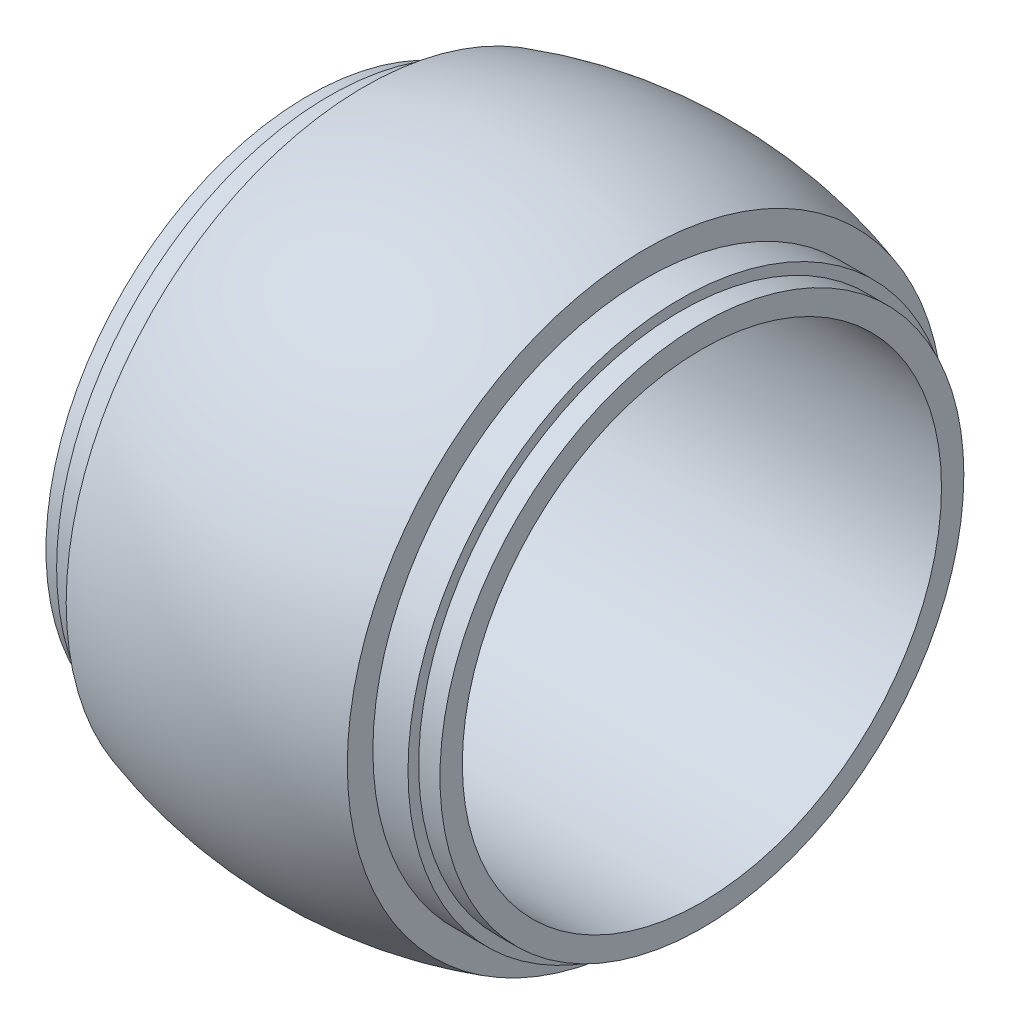
ISO-10303-21;
HEADER;
FILE_DESCRIPTION(('STEP AP214'),'2;1');
FILE_NAME('part.step','',(''),(''),'','','');
FILE_SCHEMA(('AUTOMOTIVE_DESIGN { 1 0 10303 214 1 1 1 1 }'));
ENDSEC;
DATA;
#1=APPLICATION_CONTEXT('core data for automotive mechanical design processes');
#2=APPLICATION_PROTOCOL_DEFINITION('international standard','automotive_design',2000,#1);
#3=PRODUCT_CONTEXT('',#1,'mechanical');
#4=PRODUCT('Part','Part','',(#3));
#5=PRODUCT_RELATED_PRODUCT_CATEGORY('part','',(#4));
#6=PRODUCT_DEFINITION_FORMATION('','',#4);
#7=PRODUCT_DEFINITION_CONTEXT('part definition',#1,'design');
#8=PRODUCT_DEFINITION('design','',#6,#7);
#9=PRODUCT_DEFINITION_SHAPE('','',#8);
#10=(LENGTH_UNIT() NAMED_UNIT(*) SI_UNIT(.MILLI.,.METRE.));
#11=(NAMED_UNIT(*) PLANE_ANGLE_UNIT() SI_UNIT($,.RADIAN.));
#12=(NAMED_UNIT(*) SI_UNIT($,.STERADIAN.) SOLID_ANGLE_UNIT());
#13=UNCERTAINTY_MEASURE_WITH_UNIT(LENGTH_MEASURE(1.E-05),#10,'distance_accuracy_value','');
#14=(GEOMETRIC_REPRESENTATION_CONTEXT(3) GLOBAL_UNCERTAINTY_ASSIGNED_CONTEXT((#13)) GLOBAL_UNIT_ASSIGNED_CONTEXT((#10,
#11,#12)) REPRESENTATION_CONTEXT('',''));
#15=CARTESIAN_POINT('',(0.,0.,0.));
#16=DIRECTION('',(0.,0.,1.));
#17=DIRECTION('',(1.,0.,0.));
#18=AXIS2_PLACEMENT_3D('',#15,#16,#17);
#19=CARTESIAN_POINT('',(-18.5,0.,0.));
#20=DIRECTION('',(1.,0.,0.));
#21=DIRECTION('',(0.,0.,-1.));
#22=AXIS2_PLACEMENT_3D('',#19,#20,#21);
#23=PLANE('',#22);
#24=CARTESIAN_POINT('',(-18.5,0.,0.));
#25=DIRECTION('',(1.,0.,0.));
#26=DIRECTION('',(0.,0.,-1.));
#27=AXIS2_PLACEMENT_3D('',#24,#25,#26);
#28=CIRCLE('',#27,22.5);
#29=CARTESIAN_POINT('',(-18.5,0.,-22.5));
#30=VERTEX_POINT('',#29);
#31=EDGE_CURVE('E42',#30,#30,#28,.T.);
#32=ORIENTED_EDGE('',*,*,#31,.T.);
#33=EDGE_LOOP('',(#32));
#34=FACE_BOUND('',#33,.T.);
#35=CARTESIAN_POINT('',(-18.5,0.,0.));
#36=DIRECTION('',(1.,0.,0.));
#37=DIRECTION('',(0.,0.,-1.));
#38=AXIS2_PLACEMENT_3D('',#35,#36,#37);
#39=CIRCLE('',#38,24.6);
#40=CARTESIAN_POINT('',(-18.5,0.,-24.6));
#41=VERTEX_POINT('',#40);
#42=EDGE_CURVE('E79',#41,#41,#39,.T.);
#43=ORIENTED_EDGE('',*,*,#42,.F.);
#44=EDGE_LOOP('',(#43));
#45=FACE_BOUND('',#44,.T.);
#46=ADVANCED_FACE('F39',(#34,#45),#23,.F.);
#47=CARTESIAN_POINT('',(18.5,0.,0.));
#48=DIRECTION('',(1.,0.,0.));
#49=DIRECTION('',(0.,0.,-1.));
#50=AXIS2_PLACEMENT_3D('',#47,#48,#49);
#51=PLANE('',#50);
#52=CARTESIAN_POINT('',(18.5,0.,0.));
#53=DIRECTION('',(1.,0.,0.));
#54=DIRECTION('',(0.,0.,-1.));
#55=AXIS2_PLACEMENT_3D('',#52,#53,#54);
#56=CIRCLE('',#55,24.6);
#57=CARTESIAN_POINT('',(18.5,0.,-24.6));
#58=VERTEX_POINT('',#57);
#59=EDGE_CURVE('E76',#58,#58,#56,.T.);
#60=ORIENTED_EDGE('',*,*,#59,.T.);
#61=EDGE_LOOP('',(#60));
#62=FACE_BOUND('',#61,.T.);
#63=CARTESIAN_POINT('',(18.5,0.,0.));
#64=DIRECTION('',(1.,0.,0.));
#65=DIRECTION('',(0.,0.,-1.));
#66=AXIS2_PLACEMENT_3D('',#63,#64,#65);
#67=CIRCLE('',#66,22.5);
#68=CARTESIAN_POINT('',(18.5,0.,-22.5));
#69=VERTEX_POINT('',#68);
#70=EDGE_CURVE('E10',#69,#69,#67,.T.);
#71=ORIENTED_EDGE('',*,*,#70,.F.);
#72=EDGE_LOOP('',(#71));
#73=FACE_BOUND('',#72,.T.);
#74=ADVANCED_FACE('F111',(#62,#73),#51,.T.);
#75=CARTESIAN_POINT('',(18.5,0.,0.));
#76=DIRECTION('',(-1.,0.,0.));
#77=DIRECTION('',(0.,0.,1.));
#78=AXIS2_PLACEMENT_3D('',#75,#76,#77);
#79=CYLINDRICAL_SURFACE('',#78,22.5);
#80=ORIENTED_EDGE('',*,*,#70,.T.);
#81=EDGE_LOOP('',(#80));
#82=FACE_BOUND('',#81,.T.);
#83=ORIENTED_EDGE('',*,*,#31,.F.);
#84=EDGE_LOOP('',(#83));
#85=FACE_BOUND('',#84,.T.);
#86=ADVANCED_FACE('F107',(#82,#85),#79,.F.);
#87=CARTESIAN_POINT('',(0.,0.,0.));
#88=DIRECTION('',(1.,0.,0.));
#89=DIRECTION('',(0.,0.,-1.));
#90=AXIS2_PLACEMENT_3D('',#87,#88,#89);
#91=CYLINDRICAL_SURFACE('',#90,24.6);
#92=ORIENTED_EDGE('',*,*,#42,.T.);
#93=EDGE_LOOP('',(#92));
#94=FACE_BOUND('',#93,.T.);
#95=CARTESIAN_POINT('',(-16.5,0.,0.));
#96=DIRECTION('',(1.,0.,0.));
#97=DIRECTION('',(0.,0.,-1.));
#98=AXIS2_PLACEMENT_3D('',#95,#96,#97);
#99=CIRCLE('',#98,24.6);
#100=CARTESIAN_POINT('',(-16.5,0.,-24.6));
#101=VERTEX_POINT('',#100);
#102=EDGE_CURVE('E83',#101,#101,#99,.T.);
#103=ORIENTED_EDGE('',*,*,#102,.F.);
#104=EDGE_LOOP('',(#103));
#105=FACE_BOUND('',#104,.T.);
#106=ADVANCED_FACE('F97',(#94,#105),#91,.T.);
#107=CARTESIAN_POINT('',(-16.5,0.,0.));
#108=DIRECTION('',(-1.,0.,0.));
#109=DIRECTION('',(0.,0.,1.));
#110=AXIS2_PLACEMENT_3D('',#107,#108,#109);
#111=PLANE('',#110);
#112=ORIENTED_EDGE('',*,*,#102,.T.);
#113=EDGE_LOOP('',(#112));
#114=FACE_BOUND('',#113,.T.);
#115=CARTESIAN_POINT('',(-16.5,0.,0.));
#116=DIRECTION('',(1.,0.,0.));
#117=DIRECTION('',(0.,0.,-1.));
#118=AXIS2_PLACEMENT_3D('',#115,#116,#117);
#119=CIRCLE('',#118,25.6);
#120=CARTESIAN_POINT('',(-16.5,0.,-25.6));
#121=VERTEX_POINT('',#120);
#122=EDGE_CURVE('E87',#121,#121,#119,.T.);
#123=ORIENTED_EDGE('',*,*,#122,.F.);
#124=EDGE_LOOP('',(#123));
#125=FACE_BOUND('',#124,.T.);
#126=ADVANCED_FACE('F94',(#114,#125),#111,.T.);
#127=CARTESIAN_POINT('',(16.5,0.,0.));
#128=DIRECTION('',(-1.,0.,0.));
#129=DIRECTION('',(0.,0.,1.));
#130=AXIS2_PLACEMENT_3D('',#127,#128,#129);
#131=PLANE('',#130);
#132=CARTESIAN_POINT('',(16.5,0.,0.));
#133=DIRECTION('',(1.,0.,0.));
#134=DIRECTION('',(0.,0.,-1.));
#135=AXIS2_PLACEMENT_3D('',#132,#133,#134);
#136=CIRCLE('',#135,24.6);
#137=CARTESIAN_POINT('',(16.5,0.,-24.6));
#138=VERTEX_POINT('',#137);
#139=EDGE_CURVE('E72',#138,#138,#136,.T.);
#140=ORIENTED_EDGE('',*,*,#139,.F.);
#141=EDGE_LOOP('',(#140));
#142=FACE_BOUND('',#141,.T.);
#143=CARTESIAN_POINT('',(16.5,0.,0.));
#144=DIRECTION('',(1.,0.,0.));
#145=DIRECTION('',(0.,0.,-1.));
#146=AXIS2_PLACEMENT_3D('',#143,#144,#145);
#147=CIRCLE('',#146,25.6);
#148=CARTESIAN_POINT('',(16.5,0.,-25.6));
#149=VERTEX_POINT('',#148);
#150=EDGE_CURVE('E68',#149,#149,#147,.T.);
#151=ORIENTED_EDGE('',*,*,#150,.T.);
#152=EDGE_LOOP('',(#151));
#153=FACE_BOUND('',#152,.T.);
#154=ADVANCED_FACE('F96',(#142,#153),#131,.F.);
#155=CARTESIAN_POINT('',(0.,0.,0.));
#156=DIRECTION('',(1.,0.,0.));
#157=DIRECTION('',(0.,0.,-1.));
#158=AXIS2_PLACEMENT_3D('',#155,#156,#157);
#159=CYLINDRICAL_SURFACE('',#158,24.6);
#160=ORIENTED_EDGE('',*,*,#59,.F.);
#161=EDGE_LOOP('',(#160));
#162=FACE_BOUND('',#161,.T.);
#163=ORIENTED_EDGE('',*,*,#139,.T.);
#164=EDGE_LOOP('',(#163));
#165=FACE_BOUND('',#164,.T.);
#166=ADVANCED_FACE('F104',(#162,#165),#159,.T.);
#167=CARTESIAN_POINT('',(0.,0.,0.));
#168=DIRECTION('',(-1.,0.,0.));
#169=DIRECTION('',(0.,0.,1.));
#170=AXIS2_PLACEMENT_3D('',#167,#168,#169);
#171=DEGENERATE_TOROIDAL_SURFACE('',#170,14.5600000000001,44.5600000000001,.F.);
#172=CARTESIAN_POINT('',(13.2,0.,0.));
#173=DIRECTION('',(-1.,0.,0.));
#174=DIRECTION('',(0.,0.,1.));
#175=AXIS2_PLACEMENT_3D('',#172,#173,#174);
#176=CIRCLE('',#175,28.);
#177=CARTESIAN_POINT('',(13.2,0.,28.));
#178=VERTEX_POINT('',#177);
#179=EDGE_CURVE('E64',#178,#178,#176,.T.);
#180=ORIENTED_EDGE('',*,*,#179,.T.);
#181=EDGE_LOOP('',(#180));
#182=FACE_BOUND('',#181,.T.);
#183=CARTESIAN_POINT('',(-13.2,0.,0.));
#184=DIRECTION('',(-1.,0.,0.));
#185=DIRECTION('',(0.,0.,1.));
#186=AXIS2_PLACEMENT_3D('',#183,#184,#185);
#187=CIRCLE('',#186,28.);
#188=CARTESIAN_POINT('',(-13.2,0.,28.));
#189=VERTEX_POINT('',#188);
#190=EDGE_CURVE('E52',#189,#189,#187,.T.);
#191=ORIENTED_EDGE('',*,*,#190,.F.);
#192=EDGE_LOOP('',(#191));
#193=FACE_BOUND('',#192,.T.);
#194=ADVANCED_FACE('F128',(#182,#193),#171,.F.);
#195=CARTESIAN_POINT('',(-13.2,28.,0.));
#196=DIRECTION('',(-1.,0.,0.));
#197=DIRECTION('',(0.,0.,1.));
#198=AXIS2_PLACEMENT_3D('',#195,#196,#197);
#199=PLANE('',#198);
#200=ORIENTED_EDGE('',*,*,#190,.T.);
#201=EDGE_LOOP('',(#200));
#202=FACE_BOUND('',#201,.T.);
#203=CARTESIAN_POINT('',(-13.2,0.,0.));
#204=DIRECTION('',(-1.,0.,0.));
#205=DIRECTION('',(0.,0.,1.));
#206=AXIS2_PLACEMENT_3D('',#203,#204,#205);
#207=CIRCLE('',#206,25.6);
#208=CARTESIAN_POINT('',(-13.2,0.,25.6));
#209=VERTEX_POINT('',#208);
#210=EDGE_CURVE('E56',#209,#209,#207,.T.);
#211=ORIENTED_EDGE('',*,*,#210,.F.);
#212=EDGE_LOOP('',(#211));
#213=FACE_BOUND('',#212,.T.);
#214=ADVANCED_FACE('F131',(#202,#213),#199,.T.);
#215=CARTESIAN_POINT('',(0.,0.,0.));
#216=DIRECTION('',(-1.,0.,0.));
#217=DIRECTION('',(0.,0.,1.));
#218=AXIS2_PLACEMENT_3D('',#215,#216,#217);
#219=CYLINDRICAL_SURFACE('',#218,25.6);
#220=ORIENTED_EDGE('',*,*,#210,.T.);
#221=EDGE_LOOP('',(#220));
#222=FACE_BOUND('',#221,.T.);
#223=ORIENTED_EDGE('',*,*,#122,.T.);
#224=EDGE_LOOP('',(#223));
#225=FACE_BOUND('',#224,.T.);
#226=ADVANCED_FACE('F92',(#222,#225),#219,.T.);
#227=CARTESIAN_POINT('',(0.,0.,0.));
#228=DIRECTION('',(-1.,0.,0.));
#229=DIRECTION('',(0.,0.,1.));
#230=AXIS2_PLACEMENT_3D('',#227,#228,#229);
#231=CYLINDRICAL_SURFACE('',#230,25.6);
#232=CARTESIAN_POINT('',(13.2,0.,0.));
#233=DIRECTION('',(-1.,0.,0.));
#234=DIRECTION('',(0.,0.,1.));
#235=AXIS2_PLACEMENT_3D('',#232,#233,#234);
#236=CIRCLE('',#235,25.6);
#237=CARTESIAN_POINT('',(13.2,0.,25.6));
#238=VERTEX_POINT('',#237);
#239=EDGE_CURVE('E60',#238,#238,#236,.T.);
#240=ORIENTED_EDGE('',*,*,#239,.F.);
#241=EDGE_LOOP('',(#240));
#242=FACE_BOUND('',#241,.T.);
#243=ORIENTED_EDGE('',*,*,#150,.F.);
#244=EDGE_LOOP('',(#243));
#245=FACE_BOUND('',#244,.T.);
#246=ADVANCED_FACE('F138',(#242,#245),#231,.T.);
#247=CARTESIAN_POINT('',(13.2,28.,0.));
#248=DIRECTION('',(1.,0.,0.));
#249=DIRECTION('',(0.,0.,-1.));
#250=AXIS2_PLACEMENT_3D('',#247,#248,#249);
#251=PLANE('',#250);
#252=ORIENTED_EDGE('',*,*,#239,.T.);
#253=EDGE_LOOP('',(#252));
#254=FACE_BOUND('',#253,.T.);
#255=ORIENTED_EDGE('',*,*,#179,.F.);
#256=EDGE_LOOP('',(#255));
#257=FACE_BOUND('',#256,.T.);
#258=ADVANCED_FACE('F142',(#254,#257),#251,.T.);
#259=CLOSED_SHELL('',(#46,#74,#86,#106,#126,#154,#166,#194,#214,#226,#246,#258));
#260=MANIFOLD_SOLID_BREP('B2',#259);
#261=ADVANCED_BREP_SHAPE_REPRESENTATION('',(#18,#260),#14);
#262=SHAPE_DEFINITION_REPRESENTATION(#9,#261);
ENDSEC;
END-ISO-10303-21;
